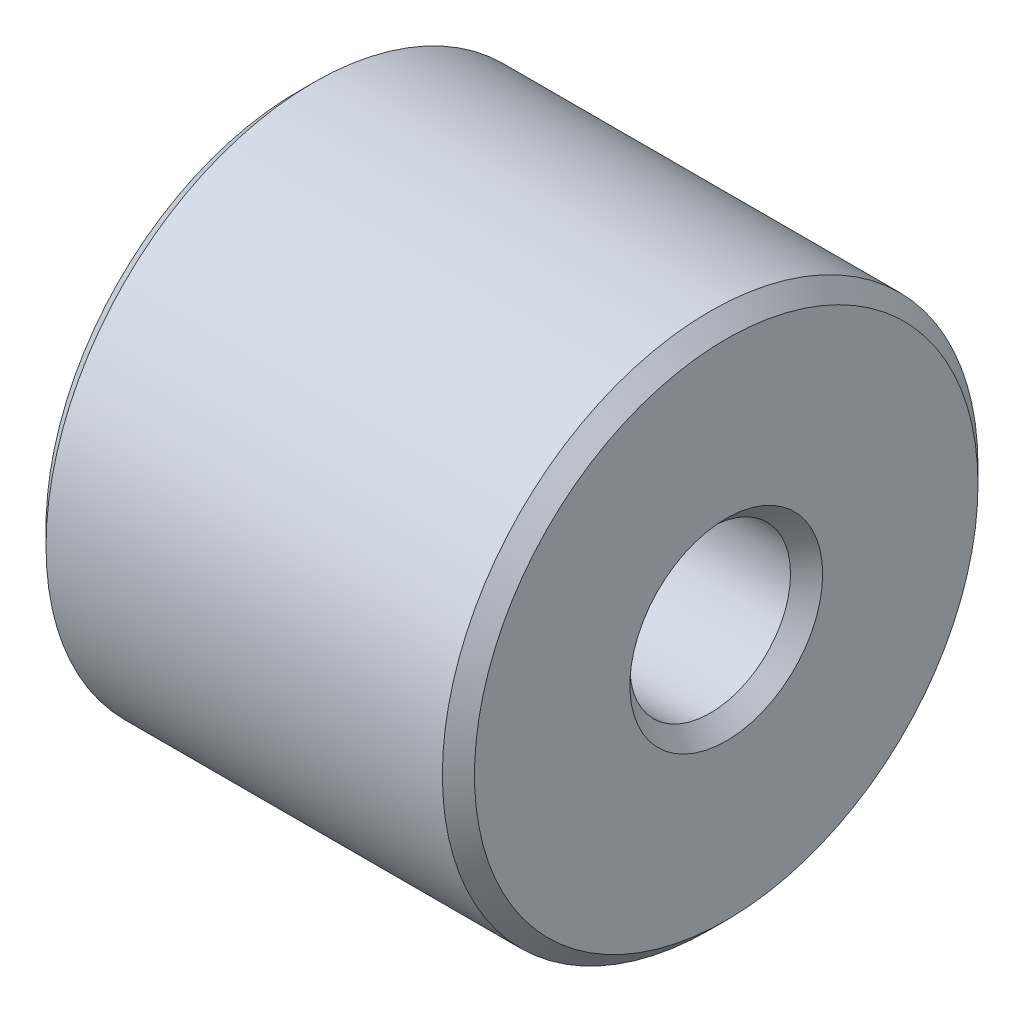
ISO-10303-21;
HEADER;
FILE_DESCRIPTION(('STEP AP214'),'2;1');
FILE_NAME('part.step','',(''),(''),'','','');
FILE_SCHEMA(('AUTOMOTIVE_DESIGN { 1 0 10303 214 1 1 1 1 }'));
ENDSEC;
DATA;
#1=APPLICATION_CONTEXT('core data for automotive mechanical design processes');
#2=APPLICATION_PROTOCOL_DEFINITION('international standard','automotive_design',2000,#1);
#3=PRODUCT_CONTEXT('',#1,'mechanical');
#4=PRODUCT('Part','Part','',(#3));
#5=PRODUCT_RELATED_PRODUCT_CATEGORY('part','',(#4));
#6=PRODUCT_DEFINITION_FORMATION('','',#4);
#7=PRODUCT_DEFINITION_CONTEXT('part definition',#1,'design');
#8=PRODUCT_DEFINITION('design','',#6,#7);
#9=PRODUCT_DEFINITION_SHAPE('','',#8);
#10=(LENGTH_UNIT() NAMED_UNIT(*) SI_UNIT(.MILLI.,.METRE.));
#11=(NAMED_UNIT(*) PLANE_ANGLE_UNIT() SI_UNIT($,.RADIAN.));
#12=(NAMED_UNIT(*) SI_UNIT($,.STERADIAN.) SOLID_ANGLE_UNIT());
#13=UNCERTAINTY_MEASURE_WITH_UNIT(LENGTH_MEASURE(1.E-05),#10,'distance_accuracy_value','');
#14=(GEOMETRIC_REPRESENTATION_CONTEXT(3) GLOBAL_UNCERTAINTY_ASSIGNED_CONTEXT((#13)) GLOBAL_UNIT_ASSIGNED_CONTEXT((#10,
#11,#12)) REPRESENTATION_CONTEXT('',''));
#15=CARTESIAN_POINT('',(0.,0.,0.));
#16=DIRECTION('',(0.,0.,1.));
#17=DIRECTION('',(1.,0.,0.));
#18=AXIS2_PLACEMENT_3D('',#15,#16,#17);
#19=CARTESIAN_POINT('',(4.,0.,0.));
#20=DIRECTION('',(1.,0.,0.));
#21=DIRECTION('',(0.,0.,-1.));
#22=AXIS2_PLACEMENT_3D('',#19,#20,#21);
#23=PLANE('',#22);
#24=CARTESIAN_POINT('',(4.,0.,0.));
#25=DIRECTION('',(1.,0.,0.));
#26=DIRECTION('',(0.,0.,-1.));
#27=AXIS2_PLACEMENT_3D('',#24,#25,#26);
#28=CIRCLE('',#27,0.900000000000002);
#29=CARTESIAN_POINT('',(4.,0.,-0.900000000000002));
#30=VERTEX_POINT('',#29);
#31=EDGE_CURVE('E10',#30,#30,#28,.F.);
#32=ORIENTED_EDGE('',*,*,#31,.T.);
#33=EDGE_LOOP('',(#32));
#34=FACE_BOUND('',#33,.T.);
#35=CARTESIAN_POINT('',(4.,0.,0.));
#36=DIRECTION('',(1.,0.,0.));
#37=DIRECTION('',(0.,0.,-1.));
#38=AXIS2_PLACEMENT_3D('',#35,#36,#37);
#39=CIRCLE('',#38,2.35);
#40=CARTESIAN_POINT('',(4.,0.,-2.35));
#41=VERTEX_POINT('',#40);
#42=EDGE_CURVE('E45',#41,#41,#39,.T.);
#43=ORIENTED_EDGE('',*,*,#42,.T.);
#44=EDGE_LOOP('',(#43));
#45=FACE_BOUND('',#44,.T.);
#46=ADVANCED_FACE('F37',(#34,#45),#23,.T.);
#47=CARTESIAN_POINT('',(0.,0.,0.));
#48=DIRECTION('',(1.,0.,0.));
#49=DIRECTION('',(0.,0.,-1.));
#50=AXIS2_PLACEMENT_3D('',#47,#48,#49);
#51=PLANE('',#50);
#52=CARTESIAN_POINT('',(0.,0.,0.));
#53=DIRECTION('',(1.,0.,0.));
#54=DIRECTION('',(0.,0.,-1.));
#55=AXIS2_PLACEMENT_3D('',#52,#53,#54);
#56=CIRCLE('',#55,0.9);
#57=CARTESIAN_POINT('',(0.,0.,-0.9));
#58=VERTEX_POINT('',#57);
#59=EDGE_CURVE('E64',#58,#58,#56,.T.);
#60=ORIENTED_EDGE('',*,*,#59,.T.);
#61=EDGE_LOOP('',(#60));
#62=FACE_BOUND('',#61,.T.);
#63=CARTESIAN_POINT('',(0.,0.,0.));
#64=DIRECTION('',(1.,0.,0.));
#65=DIRECTION('',(0.,0.,-1.));
#66=AXIS2_PLACEMENT_3D('',#63,#64,#65);
#67=CIRCLE('',#66,2.35);
#68=CARTESIAN_POINT('',(0.,0.,-2.35));
#69=VERTEX_POINT('',#68);
#70=EDGE_CURVE('E67',#69,#69,#67,.F.);
#71=ORIENTED_EDGE('',*,*,#70,.T.);
#72=EDGE_LOOP('',(#71));
#73=FACE_BOUND('',#72,.T.);
#74=ADVANCED_FACE('F71',(#62,#73),#51,.F.);
#75=CARTESIAN_POINT('',(4.,0.,0.));
#76=DIRECTION('',(-1.,0.,0.));
#77=DIRECTION('',(0.,0.,1.));
#78=AXIS2_PLACEMENT_3D('',#75,#76,#77);
#79=CYLINDRICAL_SURFACE('',#78,2.5);
#80=CARTESIAN_POINT('',(0.150000000000001,0.,0.));
#81=DIRECTION('',(1.,0.,0.));
#82=DIRECTION('',(0.,0.,-1.));
#83=AXIS2_PLACEMENT_3D('',#80,#81,#82);
#84=CIRCLE('',#83,2.5);
#85=CARTESIAN_POINT('',(0.150000000000001,0.,-2.5));
#86=VERTEX_POINT('',#85);
#87=EDGE_CURVE('E49',#86,#86,#84,.T.);
#88=ORIENTED_EDGE('',*,*,#87,.T.);
#89=EDGE_LOOP('',(#88));
#90=FACE_BOUND('',#89,.T.);
#91=CARTESIAN_POINT('',(3.85,0.,0.));
#92=DIRECTION('',(1.,0.,0.));
#93=DIRECTION('',(0.,0.,-1.));
#94=AXIS2_PLACEMENT_3D('',#91,#92,#93);
#95=CIRCLE('',#94,2.5);
#96=CARTESIAN_POINT('',(3.85,0.,-2.5));
#97=VERTEX_POINT('',#96);
#98=EDGE_CURVE('E53',#97,#97,#95,.F.);
#99=ORIENTED_EDGE('',*,*,#98,.T.);
#100=EDGE_LOOP('',(#99));
#101=FACE_BOUND('',#100,.T.);
#102=ADVANCED_FACE('F81',(#90,#101),#79,.T.);
#103=CARTESIAN_POINT('',(4.,0.,0.));
#104=DIRECTION('',(-1.,0.,0.));
#105=DIRECTION('',(0.,0.,1.));
#106=AXIS2_PLACEMENT_3D('',#103,#104,#105);
#107=CYLINDRICAL_SURFACE('',#106,0.75);
#108=CARTESIAN_POINT('',(0.149999999999999,0.,0.));
#109=DIRECTION('',(1.,0.,0.));
#110=DIRECTION('',(0.,0.,-1.));
#111=AXIS2_PLACEMENT_3D('',#108,#109,#110);
#112=CIRCLE('',#111,0.75);
#113=CARTESIAN_POINT('',(0.149999999999999,0.,-0.75));
#114=VERTEX_POINT('',#113);
#115=EDGE_CURVE('E58',#114,#114,#112,.F.);
#116=ORIENTED_EDGE('',*,*,#115,.T.);
#117=EDGE_LOOP('',(#116));
#118=FACE_BOUND('',#117,.T.);
#119=CARTESIAN_POINT('',(3.85,0.,0.));
#120=DIRECTION('',(1.,0.,0.));
#121=DIRECTION('',(0.,0.,-1.));
#122=AXIS2_PLACEMENT_3D('',#119,#120,#121);
#123=CIRCLE('',#122,0.75);
#124=CARTESIAN_POINT('',(3.85,0.,-0.75));
#125=VERTEX_POINT('',#124);
#126=EDGE_CURVE('E61',#125,#125,#123,.T.);
#127=ORIENTED_EDGE('',*,*,#126,.T.);
#128=EDGE_LOOP('',(#127));
#129=FACE_BOUND('',#128,.T.);
#130=ADVANCED_FACE('F84',(#118,#129),#107,.F.);
#131=CARTESIAN_POINT('',(0.,0.,0.));
#132=DIRECTION('',(-1.,0.,0.));
#133=DIRECTION('',(0.,0.,1.));
#134=AXIS2_PLACEMENT_3D('',#131,#132,#133);
#135=CONICAL_SURFACE('',#134,0.9,0.78539816339745);
#136=ORIENTED_EDGE('',*,*,#115,.F.);
#137=EDGE_LOOP('',(#136));
#138=FACE_BOUND('',#137,.T.);
#139=ORIENTED_EDGE('',*,*,#59,.F.);
#140=EDGE_LOOP('',(#139));
#141=FACE_BOUND('',#140,.T.);
#142=ADVANCED_FACE('F77',(#138,#141),#135,.F.);
#143=CARTESIAN_POINT('',(0.150000000000001,0.,0.));
#144=DIRECTION('',(1.,0.,0.));
#145=DIRECTION('',(0.,0.,-1.));
#146=AXIS2_PLACEMENT_3D('',#143,#144,#145);
#147=CONICAL_SURFACE('',#146,2.5,0.78539816339745);
#148=ORIENTED_EDGE('',*,*,#70,.F.);
#149=EDGE_LOOP('',(#148));
#150=FACE_BOUND('',#149,.T.);
#151=ORIENTED_EDGE('',*,*,#87,.F.);
#152=EDGE_LOOP('',(#151));
#153=FACE_BOUND('',#152,.T.);
#154=ADVANCED_FACE('F73',(#150,#153),#147,.T.);
#155=CARTESIAN_POINT('',(3.85,0.,0.));
#156=DIRECTION('',(1.,0.,0.));
#157=DIRECTION('',(0.,0.,-1.));
#158=AXIS2_PLACEMENT_3D('',#155,#156,#157);
#159=CONICAL_SURFACE('',#158,0.75,0.785398163397453);
#160=ORIENTED_EDGE('',*,*,#31,.F.);
#161=EDGE_LOOP('',(#160));
#162=FACE_BOUND('',#161,.T.);
#163=ORIENTED_EDGE('',*,*,#126,.F.);
#164=EDGE_LOOP('',(#163));
#165=FACE_BOUND('',#164,.T.);
#166=ADVANCED_FACE('F76',(#162,#165),#159,.F.);
#167=CARTESIAN_POINT('',(4.,0.,0.));
#168=DIRECTION('',(-1.,0.,0.));
#169=DIRECTION('',(0.,0.,1.));
#170=AXIS2_PLACEMENT_3D('',#167,#168,#169);
#171=CONICAL_SURFACE('',#170,2.35,0.785398163397445);
#172=ORIENTED_EDGE('',*,*,#98,.F.);
#173=EDGE_LOOP('',(#172));
#174=FACE_BOUND('',#173,.T.);
#175=ORIENTED_EDGE('',*,*,#42,.F.);
#176=EDGE_LOOP('',(#175));
#177=FACE_BOUND('',#176,.T.);
#178=ADVANCED_FACE('F40',(#174,#177),#171,.T.);
#179=CLOSED_SHELL('',(#46,#74,#102,#130,#142,#154,#166,#178));
#180=MANIFOLD_SOLID_BREP('B2',#179);
#181=ADVANCED_BREP_SHAPE_REPRESENTATION('',(#18,#180),#14);
#182=SHAPE_DEFINITION_REPRESENTATION(#9,#181);
ENDSEC;
END-ISO-10303-21;
